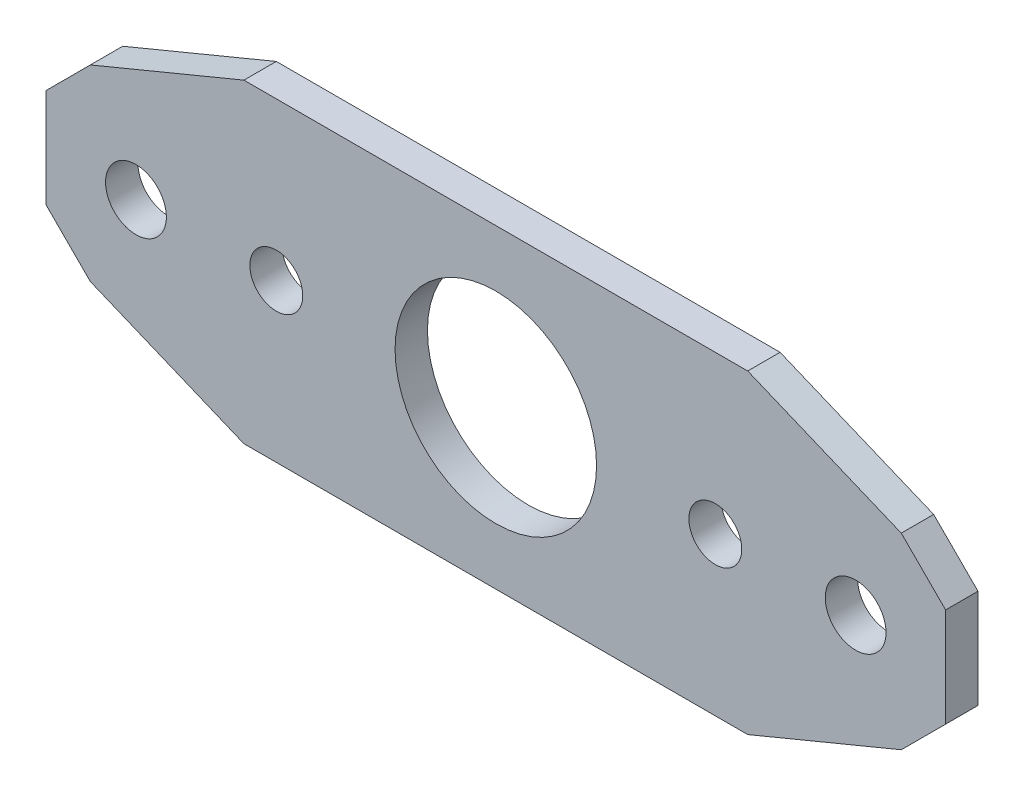
ISO-10303-21;
HEADER;
FILE_DESCRIPTION(('STEP AP214'),'2;1');
FILE_NAME('part.step','',(''),(''),'','','');
FILE_SCHEMA(('AUTOMOTIVE_DESIGN { 1 0 10303 214 1 1 1 1 }'));
ENDSEC;
DATA;
#1=APPLICATION_CONTEXT('core data for automotive mechanical design processes');
#2=APPLICATION_PROTOCOL_DEFINITION('international standard','automotive_design',2000,#1);
#3=PRODUCT_CONTEXT('',#1,'mechanical');
#4=PRODUCT('Part','Part','',(#3));
#5=PRODUCT_RELATED_PRODUCT_CATEGORY('part','',(#4));
#6=PRODUCT_DEFINITION_FORMATION('','',#4);
#7=PRODUCT_DEFINITION_CONTEXT('part definition',#1,'design');
#8=PRODUCT_DEFINITION('design','',#6,#7);
#9=PRODUCT_DEFINITION_SHAPE('','',#8);
#10=(LENGTH_UNIT() NAMED_UNIT(*) SI_UNIT(.MILLI.,.METRE.));
#11=(NAMED_UNIT(*) PLANE_ANGLE_UNIT() SI_UNIT($,.RADIAN.));
#12=(NAMED_UNIT(*) SI_UNIT($,.STERADIAN.) SOLID_ANGLE_UNIT());
#13=UNCERTAINTY_MEASURE_WITH_UNIT(LENGTH_MEASURE(1.E-05),#10,'distance_accuracy_value','');
#14=(GEOMETRIC_REPRESENTATION_CONTEXT(3) GLOBAL_UNCERTAINTY_ASSIGNED_CONTEXT((#13)) GLOBAL_UNIT_ASSIGNED_CONTEXT((#10,
#11,#12)) REPRESENTATION_CONTEXT('',''));
#15=CARTESIAN_POINT('',(0.,0.,0.));
#16=DIRECTION('',(0.,0.,1.));
#17=DIRECTION('',(1.,0.,0.));
#18=AXIS2_PLACEMENT_3D('',#15,#16,#17);
#19=CARTESIAN_POINT('',(-31.75,-11.1125,0.));
#20=DIRECTION('',(0.,0.,1.));
#21=DIRECTION('',(1.,0.,0.));
#22=AXIS2_PLACEMENT_3D('',#19,#20,#21);
#23=PLANE('',#22);
#24=DIRECTION('',(0.923879532511287,-0.38268343236509,0.));
#25=VECTOR('',#24,1.);
#26=CARTESIAN_POINT('',(17.7799999999999,11.1125,0.));
#27=LINE('',#26,#25);
#28=CARTESIAN_POINT('',(17.7799999999999,11.1125,0.));
#29=VERTEX_POINT('',#28);
#30=CARTESIAN_POINT('',(28.6201280605346,6.62237193946538,0.));
#31=VERTEX_POINT('',#30);
#32=EDGE_CURVE('E106',#29,#31,#27,.T.);
#33=ORIENTED_EDGE('',*,*,#32,.T.);
#34=DIRECTION('',(0.707106781186548,-0.707106781186547,0.));
#35=VECTOR('',#34,1.);
#36=CARTESIAN_POINT('',(24.13,11.1125,0.));
#37=LINE('',#36,#35);
#38=CARTESIAN_POINT('',(31.75,3.4925,0.));
#39=VERTEX_POINT('',#38);
#40=EDGE_CURVE('E109',#31,#39,#37,.T.);
#41=ORIENTED_EDGE('',*,*,#40,.T.);
#42=DIRECTION('',(0.,1.,0.));
#43=VECTOR('',#42,1.);
#44=CARTESIAN_POINT('',(31.75,11.1125,0.));
#45=LINE('',#44,#43);
#46=CARTESIAN_POINT('',(31.75,-3.4925,0.));
#47=VERTEX_POINT('',#46);
#48=EDGE_CURVE('E414',#39,#47,#45,.F.);
#49=ORIENTED_EDGE('',*,*,#48,.T.);
#50=DIRECTION('',(-0.707106781186548,-0.707106781186547,0.));
#51=VECTOR('',#50,1.);
#52=CARTESIAN_POINT('',(31.75,-3.4925,0.));
#53=LINE('',#52,#51);
#54=CARTESIAN_POINT('',(28.6201280605346,-6.62237193946537,0.));
#55=VERTEX_POINT('',#54);
#56=EDGE_CURVE('E409',#47,#55,#53,.T.);
#57=ORIENTED_EDGE('',*,*,#56,.T.);
#58=DIRECTION('',(-0.923879532511287,-0.38268343236509,0.));
#59=VECTOR('',#58,1.);
#60=CARTESIAN_POINT('',(17.7799999999999,-11.1125,0.));
#61=LINE('',#60,#59);
#62=CARTESIAN_POINT('',(17.7799999999999,-11.1125,0.));
#63=VERTEX_POINT('',#62);
#64=EDGE_CURVE('E406',#55,#63,#61,.T.);
#65=ORIENTED_EDGE('',*,*,#64,.T.);
#66=DIRECTION('',(1.,0.,0.));
#67=VECTOR('',#66,1.);
#68=CARTESIAN_POINT('',(-31.75,-11.1125,0.));
#69=LINE('',#68,#67);
#70=CARTESIAN_POINT('',(-17.7799999999999,-11.1125,0.));
#71=VERTEX_POINT('',#70);
#72=EDGE_CURVE('E401',#63,#71,#69,.F.);
#73=ORIENTED_EDGE('',*,*,#72,.T.);
#74=DIRECTION('',(-0.923879532511287,0.38268343236509,0.));
#75=VECTOR('',#74,1.);
#76=CARTESIAN_POINT('',(-17.7799999999999,-11.1125,0.));
#77=LINE('',#76,#75);
#78=CARTESIAN_POINT('',(-28.6201280605346,-6.62237193946538,0.));
#79=VERTEX_POINT('',#78);
#80=EDGE_CURVE('E395',#71,#79,#77,.T.);
#81=ORIENTED_EDGE('',*,*,#80,.T.);
#82=DIRECTION('',(-0.707106781186548,0.707106781186548,0.));
#83=VECTOR('',#82,1.);
#84=CARTESIAN_POINT('',(-24.13,-11.1125,0.));
#85=LINE('',#84,#83);
#86=CARTESIAN_POINT('',(-31.75,-3.4925,0.));
#87=VERTEX_POINT('',#86);
#88=EDGE_CURVE('E392',#79,#87,#85,.T.);
#89=ORIENTED_EDGE('',*,*,#88,.T.);
#90=DIRECTION('',(0.,1.,0.));
#91=VECTOR('',#90,1.);
#92=CARTESIAN_POINT('',(-31.75,11.1125,0.));
#93=LINE('',#92,#91);
#94=CARTESIAN_POINT('',(-31.75,3.4925,0.));
#95=VERTEX_POINT('',#94);
#96=EDGE_CURVE('E387',#87,#95,#93,.T.);
#97=ORIENTED_EDGE('',*,*,#96,.T.);
#98=DIRECTION('',(0.707106781186547,0.707106781186548,0.));
#99=VECTOR('',#98,1.);
#100=CARTESIAN_POINT('',(-31.75,3.4925,0.));
#101=LINE('',#100,#99);
#102=CARTESIAN_POINT('',(-28.6201280605346,6.62237193946537,0.));
#103=VERTEX_POINT('',#102);
#104=EDGE_CURVE('E381',#95,#103,#101,.T.);
#105=ORIENTED_EDGE('',*,*,#104,.T.);
#106=DIRECTION('',(0.923879532511287,0.38268343236509,0.));
#107=VECTOR('',#106,1.);
#108=CARTESIAN_POINT('',(-17.7799999999999,11.1125,0.));
#109=LINE('',#108,#107);
#110=CARTESIAN_POINT('',(-17.7799999999999,11.1125,0.));
#111=VERTEX_POINT('',#110);
#112=EDGE_CURVE('E377',#103,#111,#109,.T.);
#113=ORIENTED_EDGE('',*,*,#112,.T.);
#114=DIRECTION('',(1.,0.,0.));
#115=VECTOR('',#114,1.);
#116=CARTESIAN_POINT('',(-31.75,11.1125,0.));
#117=LINE('',#116,#115);
#118=EDGE_CURVE('E104',#111,#29,#117,.T.);
#119=ORIENTED_EDGE('',*,*,#118,.T.);
#120=EDGE_LOOP('',(#33,#41,#49,#57,#65,#73,#81,#89,#97,#105,#113,#119));
#121=FACE_BOUND('',#120,.T.);
#122=CARTESIAN_POINT('',(0.,0.,0.));
#123=DIRECTION('',(0.,0.,-1.));
#124=DIRECTION('',(-1.,0.,0.));
#125=AXIS2_PLACEMENT_3D('',#122,#123,#124);
#126=CIRCLE('',#125,7.112);
#127=CARTESIAN_POINT('',(-7.112,0.,0.));
#128=VERTEX_POINT('',#127);
#129=EDGE_CURVE('E122',#128,#128,#126,.F.);
#130=ORIENTED_EDGE('',*,*,#129,.T.);
#131=EDGE_LOOP('',(#130));
#132=FACE_BOUND('',#131,.T.);
#133=CARTESIAN_POINT('',(25.4,0.,0.));
#134=DIRECTION('',(0.,0.,-1.));
#135=DIRECTION('',(-1.,0.,0.));
#136=AXIS2_PLACEMENT_3D('',#133,#134,#135);
#137=CIRCLE('',#136,2.1463);
#138=CARTESIAN_POINT('',(23.2537,0.,0.));
#139=VERTEX_POINT('',#138);
#140=EDGE_CURVE('E151',#139,#139,#137,.F.);
#141=ORIENTED_EDGE('',*,*,#140,.T.);
#142=EDGE_LOOP('',(#141));
#143=FACE_BOUND('',#142,.T.);
#144=CARTESIAN_POINT('',(-25.4,0.,0.));
#145=DIRECTION('',(0.,0.,-1.));
#146=DIRECTION('',(-1.,0.,0.));
#147=AXIS2_PLACEMENT_3D('',#144,#145,#146);
#148=CIRCLE('',#147,2.1463);
#149=CARTESIAN_POINT('',(-27.5463,0.,0.));
#150=VERTEX_POINT('',#149);
#151=EDGE_CURVE('E154',#150,#150,#148,.F.);
#152=ORIENTED_EDGE('',*,*,#151,.T.);
#153=EDGE_LOOP('',(#152));
#154=FACE_BOUND('',#153,.T.);
#155=CARTESIAN_POINT('',(15.494,0.,0.));
#156=DIRECTION('',(0.,0.,-1.));
#157=DIRECTION('',(-1.,0.,0.));
#158=AXIS2_PLACEMENT_3D('',#155,#156,#157);
#159=CIRCLE('',#158,1.8669);
#160=CARTESIAN_POINT('',(13.6271,0.,0.));
#161=VERTEX_POINT('',#160);
#162=EDGE_CURVE('E156',#161,#161,#159,.F.);
#163=ORIENTED_EDGE('',*,*,#162,.T.);
#164=EDGE_LOOP('',(#163));
#165=FACE_BOUND('',#164,.T.);
#166=CARTESIAN_POINT('',(-15.494,0.,0.));
#167=DIRECTION('',(0.,0.,-1.));
#168=DIRECTION('',(-1.,0.,0.));
#169=AXIS2_PLACEMENT_3D('',#166,#167,#168);
#170=CIRCLE('',#169,1.8669);
#171=CARTESIAN_POINT('',(-17.3609,0.,0.));
#172=VERTEX_POINT('',#171);
#173=EDGE_CURVE('E20',#172,#172,#170,.F.);
#174=ORIENTED_EDGE('',*,*,#173,.T.);
#175=EDGE_LOOP('',(#174));
#176=FACE_BOUND('',#175,.T.);
#177=ADVANCED_FACE('F17',(#121,#132,#143,#154,#165,#176),#23,.F.);
#178=CARTESIAN_POINT('',(-15.494,0.,2.286));
#179=DIRECTION('',(0.,0.,-1.));
#180=DIRECTION('',(-1.,0.,0.));
#181=AXIS2_PLACEMENT_3D('',#178,#179,#180);
#182=CYLINDRICAL_SURFACE('',#181,1.8669);
#183=ORIENTED_EDGE('',*,*,#173,.F.);
#184=EDGE_LOOP('',(#183));
#185=FACE_BOUND('',#184,.T.);
#186=CARTESIAN_POINT('',(-15.494,0.,2.286));
#187=DIRECTION('',(0.,0.,-1.));
#188=DIRECTION('',(-1.,0.,0.));
#189=AXIS2_PLACEMENT_3D('',#186,#187,#188);
#190=CIRCLE('',#189,1.8669);
#191=CARTESIAN_POINT('',(-17.3609,0.,2.286));
#192=VERTEX_POINT('',#191);
#193=EDGE_CURVE('E146',#192,#192,#190,.T.);
#194=ORIENTED_EDGE('',*,*,#193,.F.);
#195=EDGE_LOOP('',(#194));
#196=FACE_BOUND('',#195,.T.);
#197=ADVANCED_FACE('F164',(#185,#196),#182,.F.);
#198=CARTESIAN_POINT('',(15.494,0.,2.286));
#199=DIRECTION('',(0.,0.,-1.));
#200=DIRECTION('',(-1.,0.,0.));
#201=AXIS2_PLACEMENT_3D('',#198,#199,#200);
#202=CYLINDRICAL_SURFACE('',#201,1.8669);
#203=ORIENTED_EDGE('',*,*,#162,.F.);
#204=EDGE_LOOP('',(#203));
#205=FACE_BOUND('',#204,.T.);
#206=CARTESIAN_POINT('',(15.494,0.,2.286));
#207=DIRECTION('',(0.,0.,-1.));
#208=DIRECTION('',(-1.,0.,0.));
#209=AXIS2_PLACEMENT_3D('',#206,#207,#208);
#210=CIRCLE('',#209,1.8669);
#211=CARTESIAN_POINT('',(13.6271,0.,2.286));
#212=VERTEX_POINT('',#211);
#213=EDGE_CURVE('E143',#212,#212,#210,.T.);
#214=ORIENTED_EDGE('',*,*,#213,.F.);
#215=EDGE_LOOP('',(#214));
#216=FACE_BOUND('',#215,.T.);
#217=ADVANCED_FACE('F167',(#205,#216),#202,.F.);
#218=CARTESIAN_POINT('',(-25.4,0.,2.286));
#219=DIRECTION('',(0.,0.,-1.));
#220=DIRECTION('',(-1.,0.,0.));
#221=AXIS2_PLACEMENT_3D('',#218,#219,#220);
#222=CYLINDRICAL_SURFACE('',#221,2.1463);
#223=ORIENTED_EDGE('',*,*,#151,.F.);
#224=EDGE_LOOP('',(#223));
#225=FACE_BOUND('',#224,.T.);
#226=CARTESIAN_POINT('',(-25.4,0.,2.286));
#227=DIRECTION('',(0.,0.,-1.));
#228=DIRECTION('',(-1.,0.,0.));
#229=AXIS2_PLACEMENT_3D('',#226,#227,#228);
#230=CIRCLE('',#229,2.1463);
#231=CARTESIAN_POINT('',(-27.5463,0.,2.286));
#232=VERTEX_POINT('',#231);
#233=EDGE_CURVE('E140',#232,#232,#230,.T.);
#234=ORIENTED_EDGE('',*,*,#233,.F.);
#235=EDGE_LOOP('',(#234));
#236=FACE_BOUND('',#235,.T.);
#237=ADVANCED_FACE('F230',(#225,#236),#222,.F.);
#238=CARTESIAN_POINT('',(25.4,0.,2.286));
#239=DIRECTION('',(0.,0.,-1.));
#240=DIRECTION('',(-1.,0.,0.));
#241=AXIS2_PLACEMENT_3D('',#238,#239,#240);
#242=CYLINDRICAL_SURFACE('',#241,2.1463);
#243=ORIENTED_EDGE('',*,*,#140,.F.);
#244=EDGE_LOOP('',(#243));
#245=FACE_BOUND('',#244,.T.);
#246=CARTESIAN_POINT('',(25.4,0.,2.286));
#247=DIRECTION('',(0.,0.,-1.));
#248=DIRECTION('',(-1.,0.,0.));
#249=AXIS2_PLACEMENT_3D('',#246,#247,#248);
#250=CIRCLE('',#249,2.1463);
#251=CARTESIAN_POINT('',(23.2537,0.,2.286));
#252=VERTEX_POINT('',#251);
#253=EDGE_CURVE('E137',#252,#252,#250,.T.);
#254=ORIENTED_EDGE('',*,*,#253,.F.);
#255=EDGE_LOOP('',(#254));
#256=FACE_BOUND('',#255,.T.);
#257=ADVANCED_FACE('F226',(#245,#256),#242,.F.);
#258=CARTESIAN_POINT('',(0.,0.,2.286));
#259=DIRECTION('',(0.,0.,-1.));
#260=DIRECTION('',(-1.,0.,0.));
#261=AXIS2_PLACEMENT_3D('',#258,#259,#260);
#262=CYLINDRICAL_SURFACE('',#261,7.112);
#263=ORIENTED_EDGE('',*,*,#129,.F.);
#264=EDGE_LOOP('',(#263));
#265=FACE_BOUND('',#264,.T.);
#266=CARTESIAN_POINT('',(0.,0.,2.286));
#267=DIRECTION('',(0.,0.,-1.));
#268=DIRECTION('',(-1.,0.,0.));
#269=AXIS2_PLACEMENT_3D('',#266,#267,#268);
#270=CIRCLE('',#269,7.112);
#271=CARTESIAN_POINT('',(-7.112,0.,2.286));
#272=VERTEX_POINT('',#271);
#273=EDGE_CURVE('E133',#272,#272,#270,.T.);
#274=ORIENTED_EDGE('',*,*,#273,.F.);
#275=EDGE_LOOP('',(#274));
#276=FACE_BOUND('',#275,.T.);
#277=ADVANCED_FACE('F223',(#265,#276),#262,.F.);
#278=CARTESIAN_POINT('',(24.13,11.1125,2.286));
#279=DIRECTION('',(-0.707106781186547,-0.707106781186548,0.));
#280=DIRECTION('',(0.707106781186548,-0.707106781186547,0.));
#281=AXIS2_PLACEMENT_3D('',#278,#279,#280);
#282=PLANE('',#281);
#283=DIRECTION('',(0.,0.,1.));
#284=VECTOR('',#283,1.);
#285=CARTESIAN_POINT('',(28.6201280605346,6.62237193946538,2.286));
#286=LINE('',#285,#284);
#287=CARTESIAN_POINT('',(28.6201280605346,6.62237193946537,2.286));
#288=VERTEX_POINT('',#287);
#289=EDGE_CURVE('E114',#31,#288,#286,.T.);
#290=ORIENTED_EDGE('',*,*,#289,.T.);
#291=DIRECTION('',(-0.707106781186546,0.707106781186549,0.));
#292=VECTOR('',#291,1.);
#293=CARTESIAN_POINT('',(31.75,3.49249999999999,2.286));
#294=LINE('',#293,#292);
#295=CARTESIAN_POINT('',(31.75,3.4925,2.286));
#296=VERTEX_POINT('',#295);
#297=EDGE_CURVE('E136',#296,#288,#294,.T.);
#298=ORIENTED_EDGE('',*,*,#297,.F.);
#299=DIRECTION('',(0.,0.,1.));
#300=VECTOR('',#299,1.);
#301=CARTESIAN_POINT('',(31.75,3.49249999999999,2.286));
#302=LINE('',#301,#300);
#303=EDGE_CURVE('E120',#296,#39,#302,.F.);
#304=ORIENTED_EDGE('',*,*,#303,.T.);
#305=ORIENTED_EDGE('',*,*,#40,.F.);
#306=EDGE_LOOP('',(#290,#298,#304,#305));
#307=FACE_BOUND('',#306,.T.);
#308=ADVANCED_FACE('F117',(#307),#282,.F.);
#309=CARTESIAN_POINT('',(17.7799999999999,11.1125,2.286));
#310=DIRECTION('',(-0.38268343236509,-0.923879532511287,0.));
#311=DIRECTION('',(0.923879532511287,-0.38268343236509,0.));
#312=AXIS2_PLACEMENT_3D('',#309,#310,#311);
#313=PLANE('',#312);
#314=ORIENTED_EDGE('',*,*,#289,.F.);
#315=ORIENTED_EDGE('',*,*,#32,.F.);
#316=DIRECTION('',(0.,0.,-1.));
#317=VECTOR('',#316,1.);
#318=CARTESIAN_POINT('',(17.7799999999999,11.1125,2.286));
#319=LINE('',#318,#317);
#320=CARTESIAN_POINT('',(17.7799999999999,11.1125,2.286));
#321=VERTEX_POINT('',#320);
#322=EDGE_CURVE('E129',#29,#321,#319,.F.);
#323=ORIENTED_EDGE('',*,*,#322,.T.);
#324=DIRECTION('',(-0.923879532511287,0.38268343236509,0.));
#325=VECTOR('',#324,1.);
#326=CARTESIAN_POINT('',(28.6201280605346,6.62237193946537,2.286));
#327=LINE('',#326,#325);
#328=EDGE_CURVE('E126',#288,#321,#327,.T.);
#329=ORIENTED_EDGE('',*,*,#328,.F.);
#330=EDGE_LOOP('',(#314,#315,#323,#329));
#331=FACE_BOUND('',#330,.T.);
#332=ADVANCED_FACE('F124',(#331),#313,.F.);
#333=CARTESIAN_POINT('',(-31.75,11.1125,2.286));
#334=DIRECTION('',(0.,-1.,0.));
#335=DIRECTION('',(0.,0.,-1.));
#336=AXIS2_PLACEMENT_3D('',#333,#334,#335);
#337=PLANE('',#336);
#338=ORIENTED_EDGE('',*,*,#322,.F.);
#339=ORIENTED_EDGE('',*,*,#118,.F.);
#340=DIRECTION('',(0.,0.,1.));
#341=VECTOR('',#340,1.);
#342=CARTESIAN_POINT('',(-17.7799999999999,11.1125,2.286));
#343=LINE('',#342,#341);
#344=CARTESIAN_POINT('',(-17.7799999999999,11.1125,2.286));
#345=VERTEX_POINT('',#344);
#346=EDGE_CURVE('E376',#111,#345,#343,.T.);
#347=ORIENTED_EDGE('',*,*,#346,.T.);
#348=DIRECTION('',(1.,0.,0.));
#349=VECTOR('',#348,1.);
#350=CARTESIAN_POINT('',(-31.75,11.1125,2.286));
#351=LINE('',#350,#349);
#352=EDGE_CURVE('E375',#321,#345,#351,.F.);
#353=ORIENTED_EDGE('',*,*,#352,.F.);
#354=EDGE_LOOP('',(#338,#339,#347,#353));
#355=FACE_BOUND('',#354,.T.);
#356=ADVANCED_FACE('F214',(#355),#337,.F.);
#357=CARTESIAN_POINT('',(-17.7799999999999,11.1125,2.286));
#358=DIRECTION('',(0.38268343236509,-0.923879532511287,0.));
#359=DIRECTION('',(0.923879532511287,0.38268343236509,0.));
#360=AXIS2_PLACEMENT_3D('',#357,#358,#359);
#361=PLANE('',#360);
#362=DIRECTION('',(0.,0.,1.));
#363=VECTOR('',#362,1.);
#364=CARTESIAN_POINT('',(-28.6201280605346,6.62237193946537,2.286));
#365=LINE('',#364,#363);
#366=CARTESIAN_POINT('',(-28.6201280605346,6.62237193946538,2.286));
#367=VERTEX_POINT('',#366);
#368=EDGE_CURVE('E383',#103,#367,#365,.T.);
#369=ORIENTED_EDGE('',*,*,#368,.T.);
#370=DIRECTION('',(-0.923879532511287,-0.38268343236509,0.));
#371=VECTOR('',#370,1.);
#372=CARTESIAN_POINT('',(-17.7799999999999,11.1125,2.286));
#373=LINE('',#372,#371);
#374=EDGE_CURVE('E420',#345,#367,#373,.T.);
#375=ORIENTED_EDGE('',*,*,#374,.F.);
#376=ORIENTED_EDGE('',*,*,#346,.F.);
#377=ORIENTED_EDGE('',*,*,#112,.F.);
#378=EDGE_LOOP('',(#369,#375,#376,#377));
#379=FACE_BOUND('',#378,.T.);
#380=ADVANCED_FACE('F210',(#379),#361,.F.);
#381=CARTESIAN_POINT('',(-31.75,3.4925,2.286));
#382=DIRECTION('',(0.707106781186548,-0.707106781186547,0.));
#383=DIRECTION('',(0.707106781186547,0.707106781186548,0.));
#384=AXIS2_PLACEMENT_3D('',#381,#382,#383);
#385=PLANE('',#384);
#386=ORIENTED_EDGE('',*,*,#368,.F.);
#387=ORIENTED_EDGE('',*,*,#104,.F.);
#388=DIRECTION('',(0.,0.,-1.));
#389=VECTOR('',#388,1.);
#390=CARTESIAN_POINT('',(-31.75,3.4925,2.286));
#391=LINE('',#390,#389);
#392=CARTESIAN_POINT('',(-31.75,3.4925,2.286));
#393=VERTEX_POINT('',#392);
#394=EDGE_CURVE('E385',#95,#393,#391,.F.);
#395=ORIENTED_EDGE('',*,*,#394,.T.);
#396=DIRECTION('',(-0.707106781186548,-0.707106781186547,0.));
#397=VECTOR('',#396,1.);
#398=CARTESIAN_POINT('',(-28.6201280605346,6.62237193946538,2.286));
#399=LINE('',#398,#397);
#400=EDGE_CURVE('E423',#367,#393,#399,.T.);
#401=ORIENTED_EDGE('',*,*,#400,.F.);
#402=EDGE_LOOP('',(#386,#387,#395,#401));
#403=FACE_BOUND('',#402,.T.);
#404=ADVANCED_FACE('F206',(#403),#385,.F.);
#405=CARTESIAN_POINT('',(-31.75,11.1125,2.286));
#406=DIRECTION('',(1.,0.,0.));
#407=DIRECTION('',(0.,0.,-1.));
#408=AXIS2_PLACEMENT_3D('',#405,#406,#407);
#409=PLANE('',#408);
#410=DIRECTION('',(0.,0.,1.));
#411=VECTOR('',#410,1.);
#412=CARTESIAN_POINT('',(-31.75,-3.4925,2.286));
#413=LINE('',#412,#411);
#414=CARTESIAN_POINT('',(-31.75,-3.49249999999999,2.286));
#415=VERTEX_POINT('',#414);
#416=EDGE_CURVE('E390',#87,#415,#413,.T.);
#417=ORIENTED_EDGE('',*,*,#416,.T.);
#418=DIRECTION('',(0.,1.,0.));
#419=VECTOR('',#418,1.);
#420=CARTESIAN_POINT('',(-31.75,-11.1125,2.286));
#421=LINE('',#420,#419);
#422=EDGE_CURVE('E426',#393,#415,#421,.F.);
#423=ORIENTED_EDGE('',*,*,#422,.F.);
#424=ORIENTED_EDGE('',*,*,#394,.F.);
#425=ORIENTED_EDGE('',*,*,#96,.F.);
#426=EDGE_LOOP('',(#417,#423,#424,#425));
#427=FACE_BOUND('',#426,.T.);
#428=ADVANCED_FACE('F202',(#427),#409,.F.);
#429=CARTESIAN_POINT('',(-24.13,-11.1125,2.286));
#430=DIRECTION('',(0.707106781186548,0.707106781186548,0.));
#431=DIRECTION('',(-0.707106781186548,0.707106781186548,0.));
#432=AXIS2_PLACEMENT_3D('',#429,#430,#431);
#433=PLANE('',#432);
#434=DIRECTION('',(0.,0.,1.));
#435=VECTOR('',#434,1.);
#436=CARTESIAN_POINT('',(-28.6201280605346,-6.62237193946538,2.286));
#437=LINE('',#436,#435);
#438=CARTESIAN_POINT('',(-28.6201280605346,-6.62237193946538,2.286));
#439=VERTEX_POINT('',#438);
#440=EDGE_CURVE('E397',#79,#439,#437,.T.);
#441=ORIENTED_EDGE('',*,*,#440,.T.);
#442=DIRECTION('',(0.707106781186547,-0.707106781186548,0.));
#443=VECTOR('',#442,1.);
#444=CARTESIAN_POINT('',(-31.75,-3.49249999999999,2.286));
#445=LINE('',#444,#443);
#446=EDGE_CURVE('E429',#415,#439,#445,.T.);
#447=ORIENTED_EDGE('',*,*,#446,.F.);
#448=ORIENTED_EDGE('',*,*,#416,.F.);
#449=ORIENTED_EDGE('',*,*,#88,.F.);
#450=EDGE_LOOP('',(#441,#447,#448,#449));
#451=FACE_BOUND('',#450,.T.);
#452=ADVANCED_FACE('F198',(#451),#433,.F.);
#453=CARTESIAN_POINT('',(-17.7799999999999,-11.1125,2.286));
#454=DIRECTION('',(0.38268343236509,0.923879532511287,0.));
#455=DIRECTION('',(-0.923879532511287,0.38268343236509,0.));
#456=AXIS2_PLACEMENT_3D('',#453,#454,#455);
#457=PLANE('',#456);
#458=ORIENTED_EDGE('',*,*,#440,.F.);
#459=ORIENTED_EDGE('',*,*,#80,.F.);
#460=DIRECTION('',(0.,0.,1.));
#461=VECTOR('',#460,1.);
#462=CARTESIAN_POINT('',(-17.7799999999999,-11.1125,2.286));
#463=LINE('',#462,#461);
#464=CARTESIAN_POINT('',(-17.7799999999999,-11.1125,2.286));
#465=VERTEX_POINT('',#464);
#466=EDGE_CURVE('E399',#71,#465,#463,.T.);
#467=ORIENTED_EDGE('',*,*,#466,.T.);
#468=DIRECTION('',(0.923879532511287,-0.38268343236509,0.));
#469=VECTOR('',#468,1.);
#470=CARTESIAN_POINT('',(-28.6201280605346,-6.62237193946538,2.286));
#471=LINE('',#470,#469);
#472=EDGE_CURVE('E432',#439,#465,#471,.T.);
#473=ORIENTED_EDGE('',*,*,#472,.F.);
#474=EDGE_LOOP('',(#458,#459,#467,#473));
#475=FACE_BOUND('',#474,.T.);
#476=ADVANCED_FACE('F194',(#475),#457,.F.);
#477=CARTESIAN_POINT('',(-31.75,-11.1125,2.286));
#478=DIRECTION('',(0.,1.,0.));
#479=DIRECTION('',(0.,0.,1.));
#480=AXIS2_PLACEMENT_3D('',#477,#478,#479);
#481=PLANE('',#480);
#482=DIRECTION('',(0.,0.,1.));
#483=VECTOR('',#482,1.);
#484=CARTESIAN_POINT('',(17.7799999999999,-11.1125,2.286));
#485=LINE('',#484,#483);
#486=CARTESIAN_POINT('',(17.7799999999999,-11.1125,2.286));
#487=VERTEX_POINT('',#486);
#488=EDGE_CURVE('E404',#63,#487,#485,.T.);
#489=ORIENTED_EDGE('',*,*,#488,.T.);
#490=DIRECTION('',(1.,0.,0.));
#491=VECTOR('',#490,1.);
#492=CARTESIAN_POINT('',(-31.75,-11.1125,2.286));
#493=LINE('',#492,#491);
#494=EDGE_CURVE('E435',#465,#487,#493,.T.);
#495=ORIENTED_EDGE('',*,*,#494,.F.);
#496=ORIENTED_EDGE('',*,*,#466,.F.);
#497=ORIENTED_EDGE('',*,*,#72,.F.);
#498=EDGE_LOOP('',(#489,#495,#496,#497));
#499=FACE_BOUND('',#498,.T.);
#500=ADVANCED_FACE('F190',(#499),#481,.F.);
#501=CARTESIAN_POINT('',(17.7799999999999,-11.1125,2.286));
#502=DIRECTION('',(-0.38268343236509,0.923879532511287,0.));
#503=DIRECTION('',(-0.923879532511287,-0.38268343236509,0.));
#504=AXIS2_PLACEMENT_3D('',#501,#502,#503);
#505=PLANE('',#504);
#506=DIRECTION('',(0.,0.,1.));
#507=VECTOR('',#506,1.);
#508=CARTESIAN_POINT('',(28.6201280605346,-6.62237193946535,2.286));
#509=LINE('',#508,#507);
#510=CARTESIAN_POINT('',(28.6201280605346,-6.62237193946537,2.286));
#511=VERTEX_POINT('',#510);
#512=EDGE_CURVE('E411',#55,#511,#509,.T.);
#513=ORIENTED_EDGE('',*,*,#512,.T.);
#514=DIRECTION('',(0.923879532511287,0.38268343236509,0.));
#515=VECTOR('',#514,1.);
#516=CARTESIAN_POINT('',(17.7799999999999,-11.1125,2.286));
#517=LINE('',#516,#515);
#518=EDGE_CURVE('E438',#487,#511,#517,.T.);
#519=ORIENTED_EDGE('',*,*,#518,.F.);
#520=ORIENTED_EDGE('',*,*,#488,.F.);
#521=ORIENTED_EDGE('',*,*,#64,.F.);
#522=EDGE_LOOP('',(#513,#519,#520,#521));
#523=FACE_BOUND('',#522,.T.);
#524=ADVANCED_FACE('F187',(#523),#505,.F.);
#525=CARTESIAN_POINT('',(31.75,-3.4925,2.286));
#526=DIRECTION('',(-0.707106781186547,0.707106781186548,0.));
#527=DIRECTION('',(-0.707106781186548,-0.707106781186547,0.));
#528=AXIS2_PLACEMENT_3D('',#525,#526,#527);
#529=PLANE('',#528);
#530=ORIENTED_EDGE('',*,*,#512,.F.);
#531=ORIENTED_EDGE('',*,*,#56,.F.);
#532=DIRECTION('',(0.,0.,1.));
#533=VECTOR('',#532,1.);
#534=CARTESIAN_POINT('',(31.75,-3.4925,2.286));
#535=LINE('',#534,#533);
#536=CARTESIAN_POINT('',(31.75,-3.4925,2.286));
#537=VERTEX_POINT('',#536);
#538=EDGE_CURVE('E35',#47,#537,#535,.T.);
#539=ORIENTED_EDGE('',*,*,#538,.T.);
#540=DIRECTION('',(0.707106781186548,0.707106781186547,0.));
#541=VECTOR('',#540,1.);
#542=CARTESIAN_POINT('',(28.6201280605346,-6.62237193946538,2.286));
#543=LINE('',#542,#541);
#544=EDGE_CURVE('E26',#511,#537,#543,.T.);
#545=ORIENTED_EDGE('',*,*,#544,.F.);
#546=EDGE_LOOP('',(#530,#531,#539,#545));
#547=FACE_BOUND('',#546,.T.);
#548=ADVANCED_FACE('F179',(#547),#529,.F.);
#549=CARTESIAN_POINT('',(31.75,11.1125,2.286));
#550=DIRECTION('',(-1.,0.,0.));
#551=DIRECTION('',(0.,0.,1.));
#552=AXIS2_PLACEMENT_3D('',#549,#550,#551);
#553=PLANE('',#552);
#554=ORIENTED_EDGE('',*,*,#538,.F.);
#555=ORIENTED_EDGE('',*,*,#48,.F.);
#556=ORIENTED_EDGE('',*,*,#303,.F.);
#557=DIRECTION('',(0.,1.,0.));
#558=VECTOR('',#557,1.);
#559=CARTESIAN_POINT('',(31.75,-11.1125,2.286));
#560=LINE('',#559,#558);
#561=EDGE_CURVE('E11',#537,#296,#560,.T.);
#562=ORIENTED_EDGE('',*,*,#561,.F.);
#563=EDGE_LOOP('',(#554,#555,#556,#562));
#564=FACE_BOUND('',#563,.T.);
#565=ADVANCED_FACE('F172',(#564),#553,.F.);
#566=CARTESIAN_POINT('',(-31.75,-11.1125,2.286));
#567=DIRECTION('',(0.,0.,1.));
#568=DIRECTION('',(1.,0.,0.));
#569=AXIS2_PLACEMENT_3D('',#566,#567,#568);
#570=PLANE('',#569);
#571=ORIENTED_EDGE('',*,*,#544,.T.);
#572=ORIENTED_EDGE('',*,*,#561,.T.);
#573=ORIENTED_EDGE('',*,*,#297,.T.);
#574=ORIENTED_EDGE('',*,*,#328,.T.);
#575=ORIENTED_EDGE('',*,*,#352,.T.);
#576=ORIENTED_EDGE('',*,*,#374,.T.);
#577=ORIENTED_EDGE('',*,*,#400,.T.);
#578=ORIENTED_EDGE('',*,*,#422,.T.);
#579=ORIENTED_EDGE('',*,*,#446,.T.);
#580=ORIENTED_EDGE('',*,*,#472,.T.);
#581=ORIENTED_EDGE('',*,*,#494,.T.);
#582=ORIENTED_EDGE('',*,*,#518,.T.);
#583=EDGE_LOOP('',(#571,#572,#573,#574,#575,#576,#577,#578,#579,#580,#581,#582));
#584=FACE_BOUND('',#583,.T.);
#585=ORIENTED_EDGE('',*,*,#273,.T.);
#586=EDGE_LOOP('',(#585));
#587=FACE_BOUND('',#586,.T.);
#588=ORIENTED_EDGE('',*,*,#253,.T.);
#589=EDGE_LOOP('',(#588));
#590=FACE_BOUND('',#589,.T.);
#591=ORIENTED_EDGE('',*,*,#233,.T.);
#592=EDGE_LOOP('',(#591));
#593=FACE_BOUND('',#592,.T.);
#594=ORIENTED_EDGE('',*,*,#213,.T.);
#595=EDGE_LOOP('',(#594));
#596=FACE_BOUND('',#595,.T.);
#597=ORIENTED_EDGE('',*,*,#193,.T.);
#598=EDGE_LOOP('',(#597));
#599=FACE_BOUND('',#598,.T.);
#600=ADVANCED_FACE('F170',(#584,#587,#590,#593,#596,#599),#570,.T.);
#601=CLOSED_SHELL('',(#177,#197,#217,#237,#257,#277,#308,#332,#356,#380,#404,#428,#452,#476,
#500,#524,#548,#565,#600));
#602=MANIFOLD_SOLID_BREP('B1',#601);
#603=ADVANCED_BREP_SHAPE_REPRESENTATION('',(#18,#602),#14);
#604=SHAPE_DEFINITION_REPRESENTATION(#9,#603);
ENDSEC;
END-ISO-10303-21;
